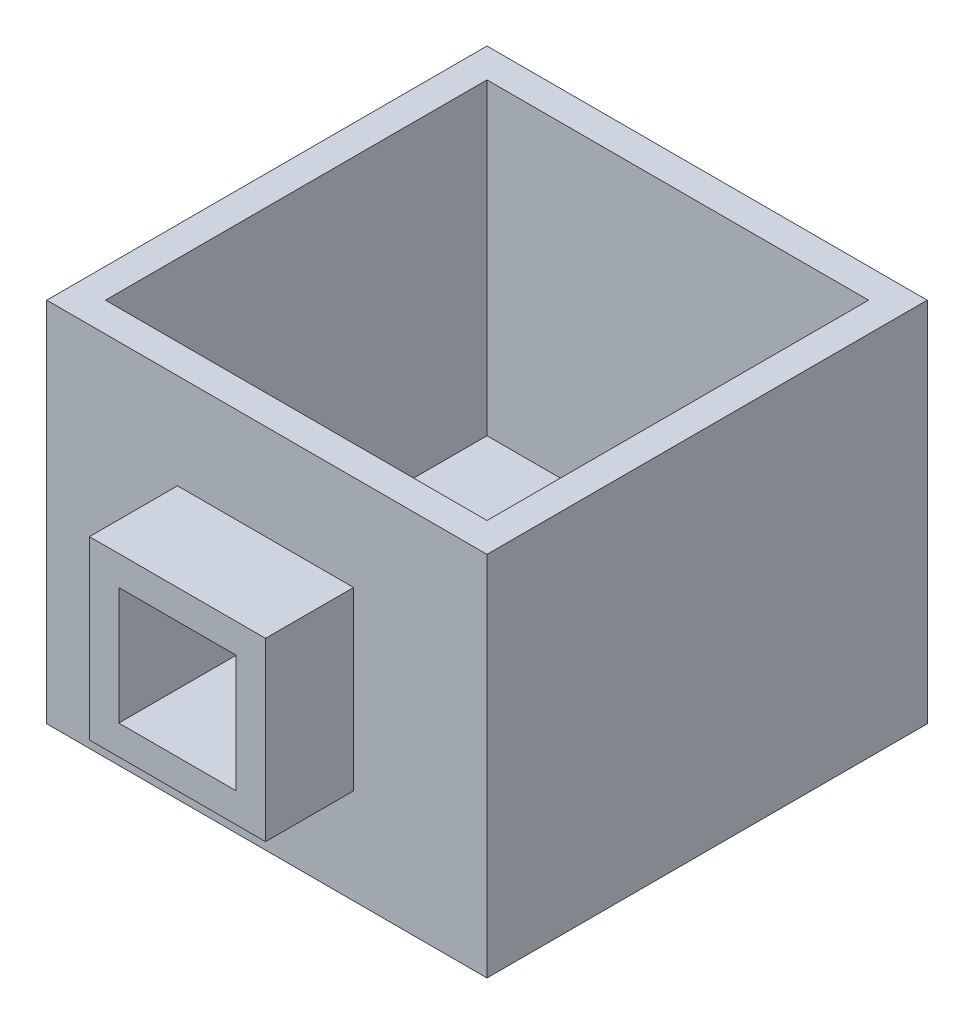
ISO-10303-21;
HEADER;
FILE_DESCRIPTION(('STEP AP214'),'2;1');
FILE_NAME('part.step','',(''),(''),'','','');
FILE_SCHEMA(('AUTOMOTIVE_DESIGN { 1 0 10303 214 1 1 1 1 }'));
ENDSEC;
DATA;
#1=APPLICATION_CONTEXT('core data for automotive mechanical design processes');
#2=APPLICATION_PROTOCOL_DEFINITION('international standard','automotive_design',2000,#1);
#3=PRODUCT_CONTEXT('',#1,'mechanical');
#4=PRODUCT('Part','Part','',(#3));
#5=PRODUCT_RELATED_PRODUCT_CATEGORY('part','',(#4));
#6=PRODUCT_DEFINITION_FORMATION('','',#4);
#7=PRODUCT_DEFINITION_CONTEXT('part definition',#1,'design');
#8=PRODUCT_DEFINITION('design','',#6,#7);
#9=PRODUCT_DEFINITION_SHAPE('','',#8);
#10=(LENGTH_UNIT() NAMED_UNIT(*) SI_UNIT(.MILLI.,.METRE.));
#11=(NAMED_UNIT(*) PLANE_ANGLE_UNIT() SI_UNIT($,.RADIAN.));
#12=(NAMED_UNIT(*) SI_UNIT($,.STERADIAN.) SOLID_ANGLE_UNIT());
#13=UNCERTAINTY_MEASURE_WITH_UNIT(LENGTH_MEASURE(1.E-05),#10,'distance_accuracy_value','');
#14=(GEOMETRIC_REPRESENTATION_CONTEXT(3) GLOBAL_UNCERTAINTY_ASSIGNED_CONTEXT((#13)) GLOBAL_UNIT_ASSIGNED_CONTEXT((#10,
#11,#12)) REPRESENTATION_CONTEXT('',''));
#15=CARTESIAN_POINT('',(0.,0.,0.));
#16=DIRECTION('',(0.,0.,1.));
#17=DIRECTION('',(1.,0.,0.));
#18=AXIS2_PLACEMENT_3D('',#15,#16,#17);
#19=CARTESIAN_POINT('',(0.,-250.,0.));
#20=DIRECTION('',(-1.,0.,0.));
#21=DIRECTION('',(0.,0.,1.));
#22=AXIS2_PLACEMENT_3D('',#19,#20,#21);
#23=PLANE('',#22);
#24=DIRECTION('',(0.,0.,1.));
#25=VECTOR('',#24,1.);
#26=CARTESIAN_POINT('',(0.,0.,0.));
#27=LINE('',#26,#25);
#28=CARTESIAN_POINT('',(0.,0.,0.));
#29=VERTEX_POINT('',#28);
#30=CARTESIAN_POINT('',(0.,0.,300.));
#31=VERTEX_POINT('',#30);
#32=EDGE_CURVE('E233',#29,#31,#27,.T.);
#33=ORIENTED_EDGE('',*,*,#32,.F.);
#34=DIRECTION('',(0.,1.,0.));
#35=VECTOR('',#34,1.);
#36=CARTESIAN_POINT('',(0.,-250.,0.));
#37=LINE('',#36,#35);
#38=CARTESIAN_POINT('',(0.,-250.,0.));
#39=VERTEX_POINT('',#38);
#40=EDGE_CURVE('E11',#39,#29,#37,.T.);
#41=ORIENTED_EDGE('',*,*,#40,.F.);
#42=DIRECTION('',(0.,0.,1.));
#43=VECTOR('',#42,1.);
#44=CARTESIAN_POINT('',(0.,-250.,0.));
#45=LINE('',#44,#43);
#46=CARTESIAN_POINT('',(0.,-250.,300.));
#47=VERTEX_POINT('',#46);
#48=EDGE_CURVE('E240',#39,#47,#45,.T.);
#49=ORIENTED_EDGE('',*,*,#48,.T.);
#50=DIRECTION('',(0.,1.,0.));
#51=VECTOR('',#50,1.);
#52=CARTESIAN_POINT('',(0.,-250.,300.));
#53=LINE('',#52,#51);
#54=EDGE_CURVE('E36',#47,#31,#53,.T.);
#55=ORIENTED_EDGE('',*,*,#54,.T.);
#56=EDGE_LOOP('',(#33,#41,#49,#55));
#57=FACE_BOUND('',#56,.T.);
#58=ADVANCED_FACE('F33',(#57),#23,.T.);
#59=CARTESIAN_POINT('',(0.,-250.,0.));
#60=DIRECTION('',(0.,0.,-1.));
#61=DIRECTION('',(-1.,0.,0.));
#62=AXIS2_PLACEMENT_3D('',#59,#60,#61);
#63=PLANE('',#62);
#64=DIRECTION('',(-1.,0.,0.));
#65=VECTOR('',#64,1.);
#66=CARTESIAN_POINT('',(0.,0.,0.));
#67=LINE('',#66,#65);
#68=CARTESIAN_POINT('',(300.,0.,0.));
#69=VERTEX_POINT('',#68);
#70=EDGE_CURVE('E244',#69,#29,#67,.T.);
#71=ORIENTED_EDGE('',*,*,#70,.F.);
#72=DIRECTION('',(0.,1.,0.));
#73=VECTOR('',#72,1.);
#74=CARTESIAN_POINT('',(300.,-250.,0.));
#75=LINE('',#74,#73);
#76=CARTESIAN_POINT('',(300.,-250.,0.));
#77=VERTEX_POINT('',#76);
#78=EDGE_CURVE('E41',#77,#69,#75,.T.);
#79=ORIENTED_EDGE('',*,*,#78,.F.);
#80=DIRECTION('',(-1.,0.,0.));
#81=VECTOR('',#80,1.);
#82=CARTESIAN_POINT('',(0.,-250.,0.));
#83=LINE('',#82,#81);
#84=EDGE_CURVE('E250',#77,#39,#83,.T.);
#85=ORIENTED_EDGE('',*,*,#84,.T.);
#86=ORIENTED_EDGE('',*,*,#40,.T.);
#87=EDGE_LOOP('',(#71,#79,#85,#86));
#88=FACE_BOUND('',#87,.T.);
#89=ADVANCED_FACE('F276',(#88),#63,.T.);
#90=CARTESIAN_POINT('',(300.,-250.,0.));
#91=DIRECTION('',(1.,0.,0.));
#92=DIRECTION('',(0.,0.,-1.));
#93=AXIS2_PLACEMENT_3D('',#90,#91,#92);
#94=PLANE('',#93);
#95=DIRECTION('',(0.,0.,-1.));
#96=VECTOR('',#95,1.);
#97=CARTESIAN_POINT('',(300.,0.,0.));
#98=LINE('',#97,#96);
#99=CARTESIAN_POINT('',(300.,0.,300.));
#100=VERTEX_POINT('',#99);
#101=EDGE_CURVE('E258',#100,#69,#98,.T.);
#102=ORIENTED_EDGE('',*,*,#101,.F.);
#103=DIRECTION('',(0.,1.,0.));
#104=VECTOR('',#103,1.);
#105=CARTESIAN_POINT('',(300.,-250.,300.));
#106=LINE('',#105,#104);
#107=CARTESIAN_POINT('',(300.,-250.,300.));
#108=VERTEX_POINT('',#107);
#109=EDGE_CURVE('E263',#108,#100,#106,.T.);
#110=ORIENTED_EDGE('',*,*,#109,.F.);
#111=DIRECTION('',(0.,0.,-1.));
#112=VECTOR('',#111,1.);
#113=CARTESIAN_POINT('',(300.,-250.,0.));
#114=LINE('',#113,#112);
#115=EDGE_CURVE('E247',#108,#77,#114,.T.);
#116=ORIENTED_EDGE('',*,*,#115,.T.);
#117=ORIENTED_EDGE('',*,*,#78,.T.);
#118=EDGE_LOOP('',(#102,#110,#116,#117));
#119=FACE_BOUND('',#118,.T.);
#120=ADVANCED_FACE('F282',(#119),#94,.T.);
#121=CARTESIAN_POINT('',(0.,-250.,300.));
#122=DIRECTION('',(0.,0.,1.));
#123=DIRECTION('',(1.,0.,0.));
#124=AXIS2_PLACEMENT_3D('',#121,#122,#123);
#125=PLANE('',#124);
#126=DIRECTION('',(0.,-1.,0.));
#127=VECTOR('',#126,1.);
#128=CARTESIAN_POINT('',(89.0887472113792,-65.,300.));
#129=LINE('',#128,#127);
#130=CARTESIAN_POINT('',(89.0887472113792,-65.,300.));
#131=VERTEX_POINT('',#130);
#132=CARTESIAN_POINT('',(89.0887472113792,-185.,300.));
#133=VERTEX_POINT('',#132);
#134=EDGE_CURVE('E174',#131,#133,#129,.T.);
#135=ORIENTED_EDGE('',*,*,#134,.F.);
#136=DIRECTION('',(-1.,0.,0.));
#137=VECTOR('',#136,1.);
#138=CARTESIAN_POINT('',(89.0887472113792,-65.,300.));
#139=LINE('',#138,#137);
#140=CARTESIAN_POINT('',(209.088747211379,-65.,300.));
#141=VERTEX_POINT('',#140);
#142=EDGE_CURVE('E179',#141,#131,#139,.T.);
#143=ORIENTED_EDGE('',*,*,#142,.F.);
#144=DIRECTION('',(0.,1.,0.));
#145=VECTOR('',#144,1.);
#146=CARTESIAN_POINT('',(209.088747211379,-65.,300.));
#147=LINE('',#146,#145);
#148=CARTESIAN_POINT('',(209.088747211379,-185.,300.));
#149=VERTEX_POINT('',#148);
#150=EDGE_CURVE('E191',#149,#141,#147,.T.);
#151=ORIENTED_EDGE('',*,*,#150,.F.);
#152=DIRECTION('',(1.,0.,0.));
#153=VECTOR('',#152,1.);
#154=CARTESIAN_POINT('',(89.0887472113792,-185.,300.));
#155=LINE('',#154,#153);
#156=EDGE_CURVE('E188',#133,#149,#155,.T.);
#157=ORIENTED_EDGE('',*,*,#156,.F.);
#158=EDGE_LOOP('',(#135,#143,#151,#157));
#159=FACE_BOUND('',#158,.T.);
#160=DIRECTION('',(1.,0.,0.));
#161=VECTOR('',#160,1.);
#162=CARTESIAN_POINT('',(0.,0.,300.));
#163=LINE('',#162,#161);
#164=EDGE_CURVE('E255',#31,#100,#163,.T.);
#165=ORIENTED_EDGE('',*,*,#164,.F.);
#166=ORIENTED_EDGE('',*,*,#54,.F.);
#167=DIRECTION('',(1.,0.,0.));
#168=VECTOR('',#167,1.);
#169=CARTESIAN_POINT('',(0.,-250.,300.));
#170=LINE('',#169,#168);
#171=EDGE_CURVE('E243',#47,#108,#170,.T.);
#172=ORIENTED_EDGE('',*,*,#171,.T.);
#173=ORIENTED_EDGE('',*,*,#109,.T.);
#174=EDGE_LOOP('',(#165,#166,#172,#173));
#175=FACE_BOUND('',#174,.T.);
#176=ADVANCED_FACE('F271',(#159,#175),#125,.T.);
#177=CARTESIAN_POINT('',(0.,-250.,0.));
#178=DIRECTION('',(0.,1.,0.));
#179=DIRECTION('',(0.,0.,1.));
#180=AXIS2_PLACEMENT_3D('',#177,#178,#179);
#181=PLANE('',#180);
#182=ORIENTED_EDGE('',*,*,#48,.F.);
#183=ORIENTED_EDGE('',*,*,#84,.F.);
#184=ORIENTED_EDGE('',*,*,#115,.F.);
#185=ORIENTED_EDGE('',*,*,#171,.F.);
#186=EDGE_LOOP('',(#182,#183,#184,#185));
#187=FACE_BOUND('',#186,.T.);
#188=ADVANCED_FACE('F279',(#187),#181,.F.);
#189=CARTESIAN_POINT('',(0.,0.,0.));
#190=DIRECTION('',(0.,1.,0.));
#191=DIRECTION('',(0.,0.,1.));
#192=AXIS2_PLACEMENT_3D('',#189,#190,#191);
#193=PLANE('',#192);
#194=DIRECTION('',(0.,0.,1.));
#195=VECTOR('',#194,1.);
#196=CARTESIAN_POINT('',(20.,0.,20.));
#197=LINE('',#196,#195);
#198=CARTESIAN_POINT('',(20.,0.,20.));
#199=VERTEX_POINT('',#198);
#200=CARTESIAN_POINT('',(20.,0.,280.));
#201=VERTEX_POINT('',#200);
#202=EDGE_CURVE('E207',#199,#201,#197,.T.);
#203=ORIENTED_EDGE('',*,*,#202,.F.);
#204=DIRECTION('',(-1.,0.,0.));
#205=VECTOR('',#204,1.);
#206=CARTESIAN_POINT('',(20.,0.,20.));
#207=LINE('',#206,#205);
#208=CARTESIAN_POINT('',(280.,0.,20.));
#209=VERTEX_POINT('',#208);
#210=EDGE_CURVE('E212',#209,#199,#207,.T.);
#211=ORIENTED_EDGE('',*,*,#210,.F.);
#212=DIRECTION('',(0.,0.,-1.));
#213=VECTOR('',#212,1.);
#214=CARTESIAN_POINT('',(280.,0.,20.));
#215=LINE('',#214,#213);
#216=CARTESIAN_POINT('',(280.,0.,280.));
#217=VERTEX_POINT('',#216);
#218=EDGE_CURVE('E226',#217,#209,#215,.T.);
#219=ORIENTED_EDGE('',*,*,#218,.F.);
#220=DIRECTION('',(1.,0.,0.));
#221=VECTOR('',#220,1.);
#222=CARTESIAN_POINT('',(20.,0.,280.));
#223=LINE('',#222,#221);
#224=EDGE_CURVE('E223',#201,#217,#223,.T.);
#225=ORIENTED_EDGE('',*,*,#224,.F.);
#226=EDGE_LOOP('',(#203,#211,#219,#225));
#227=FACE_BOUND('',#226,.T.);
#228=ORIENTED_EDGE('',*,*,#32,.T.);
#229=ORIENTED_EDGE('',*,*,#164,.T.);
#230=ORIENTED_EDGE('',*,*,#101,.T.);
#231=ORIENTED_EDGE('',*,*,#70,.T.);
#232=EDGE_LOOP('',(#228,#229,#230,#231));
#233=FACE_BOUND('',#232,.T.);
#234=ADVANCED_FACE('F273',(#227,#233),#193,.T.);
#235=CARTESIAN_POINT('',(20.,-210.,20.));
#236=DIRECTION('',(-1.,0.,0.));
#237=DIRECTION('',(0.,0.,1.));
#238=AXIS2_PLACEMENT_3D('',#235,#236,#237);
#239=PLANE('',#238);
#240=ORIENTED_EDGE('',*,*,#202,.T.);
#241=DIRECTION('',(0.,1.,0.));
#242=VECTOR('',#241,1.);
#243=CARTESIAN_POINT('',(20.,-210.,280.));
#244=LINE('',#243,#242);
#245=CARTESIAN_POINT('',(20.,-210.,280.));
#246=VERTEX_POINT('',#245);
#247=EDGE_CURVE('E221',#246,#201,#244,.T.);
#248=ORIENTED_EDGE('',*,*,#247,.F.);
#249=DIRECTION('',(0.,0.,1.));
#250=VECTOR('',#249,1.);
#251=CARTESIAN_POINT('',(20.,-210.,20.));
#252=LINE('',#251,#250);
#253=CARTESIAN_POINT('',(20.,-210.,20.));
#254=VERTEX_POINT('',#253);
#255=EDGE_CURVE('E208',#254,#246,#252,.T.);
#256=ORIENTED_EDGE('',*,*,#255,.F.);
#257=DIRECTION('',(0.,1.,0.));
#258=VECTOR('',#257,1.);
#259=CARTESIAN_POINT('',(20.,-210.,20.));
#260=LINE('',#259,#258);
#261=EDGE_CURVE('E231',#254,#199,#260,.T.);
#262=ORIENTED_EDGE('',*,*,#261,.T.);
#263=EDGE_LOOP('',(#240,#248,#256,#262));
#264=FACE_BOUND('',#263,.T.);
#265=ADVANCED_FACE('F320',(#264),#239,.F.);
#266=CARTESIAN_POINT('',(20.,-210.,20.));
#267=DIRECTION('',(0.,0.,-1.));
#268=DIRECTION('',(-1.,0.,0.));
#269=AXIS2_PLACEMENT_3D('',#266,#267,#268);
#270=PLANE('',#269);
#271=ORIENTED_EDGE('',*,*,#210,.T.);
#272=ORIENTED_EDGE('',*,*,#261,.F.);
#273=DIRECTION('',(-1.,0.,0.));
#274=VECTOR('',#273,1.);
#275=CARTESIAN_POINT('',(20.,-210.,20.));
#276=LINE('',#275,#274);
#277=CARTESIAN_POINT('',(280.,-210.,20.));
#278=VERTEX_POINT('',#277);
#279=EDGE_CURVE('E218',#278,#254,#276,.T.);
#280=ORIENTED_EDGE('',*,*,#279,.F.);
#281=DIRECTION('',(0.,1.,0.));
#282=VECTOR('',#281,1.);
#283=CARTESIAN_POINT('',(280.,-210.,20.));
#284=LINE('',#283,#282);
#285=EDGE_CURVE('E234',#278,#209,#284,.T.);
#286=ORIENTED_EDGE('',*,*,#285,.T.);
#287=EDGE_LOOP('',(#271,#272,#280,#286));
#288=FACE_BOUND('',#287,.T.);
#289=ADVANCED_FACE('F330',(#288),#270,.F.);
#290=CARTESIAN_POINT('',(280.,-210.,20.));
#291=DIRECTION('',(1.,0.,0.));
#292=DIRECTION('',(0.,0.,-1.));
#293=AXIS2_PLACEMENT_3D('',#290,#291,#292);
#294=PLANE('',#293);
#295=ORIENTED_EDGE('',*,*,#218,.T.);
#296=ORIENTED_EDGE('',*,*,#285,.F.);
#297=DIRECTION('',(0.,0.,-1.));
#298=VECTOR('',#297,1.);
#299=CARTESIAN_POINT('',(280.,-210.,20.));
#300=LINE('',#299,#298);
#301=CARTESIAN_POINT('',(280.,-210.,280.));
#302=VERTEX_POINT('',#301);
#303=EDGE_CURVE('E215',#302,#278,#300,.T.);
#304=ORIENTED_EDGE('',*,*,#303,.F.);
#305=DIRECTION('',(0.,1.,0.));
#306=VECTOR('',#305,1.);
#307=CARTESIAN_POINT('',(280.,-210.,280.));
#308=LINE('',#307,#306);
#309=EDGE_CURVE('E236',#302,#217,#308,.T.);
#310=ORIENTED_EDGE('',*,*,#309,.T.);
#311=EDGE_LOOP('',(#295,#296,#304,#310));
#312=FACE_BOUND('',#311,.T.);
#313=ADVANCED_FACE('F340',(#312),#294,.F.);
#314=CARTESIAN_POINT('',(20.,-210.,280.));
#315=DIRECTION('',(0.,0.,1.));
#316=DIRECTION('',(1.,0.,0.));
#317=AXIS2_PLACEMENT_3D('',#314,#315,#316);
#318=PLANE('',#317);
#319=DIRECTION('',(0.,1.,0.));
#320=VECTOR('',#319,1.);
#321=CARTESIAN_POINT('',(109.088747211379,-85.,280.));
#322=LINE('',#321,#320);
#323=CARTESIAN_POINT('',(109.088747211379,-165.,280.));
#324=VERTEX_POINT('',#323);
#325=CARTESIAN_POINT('',(109.088747211379,-85.,280.));
#326=VERTEX_POINT('',#325);
#327=EDGE_CURVE('E157',#324,#326,#322,.T.);
#328=ORIENTED_EDGE('',*,*,#327,.F.);
#329=DIRECTION('',(-1.,0.,0.));
#330=VECTOR('',#329,1.);
#331=CARTESIAN_POINT('',(109.088747211379,-165.,280.));
#332=LINE('',#331,#330);
#333=CARTESIAN_POINT('',(189.088747211379,-165.,280.));
#334=VERTEX_POINT('',#333);
#335=EDGE_CURVE('E49',#334,#324,#332,.T.);
#336=ORIENTED_EDGE('',*,*,#335,.F.);
#337=DIRECTION('',(0.,-1.,0.));
#338=VECTOR('',#337,1.);
#339=CARTESIAN_POINT('',(189.088747211379,-85.,280.));
#340=LINE('',#339,#338);
#341=CARTESIAN_POINT('',(189.088747211379,-85.,280.));
#342=VERTEX_POINT('',#341);
#343=EDGE_CURVE('E164',#342,#334,#340,.T.);
#344=ORIENTED_EDGE('',*,*,#343,.F.);
#345=DIRECTION('',(1.,0.,0.));
#346=VECTOR('',#345,1.);
#347=CARTESIAN_POINT('',(109.088747211379,-85.,280.));
#348=LINE('',#347,#346);
#349=EDGE_CURVE('E148',#326,#342,#348,.T.);
#350=ORIENTED_EDGE('',*,*,#349,.F.);
#351=EDGE_LOOP('',(#328,#336,#344,#350));
#352=FACE_BOUND('',#351,.T.);
#353=ORIENTED_EDGE('',*,*,#224,.T.);
#354=ORIENTED_EDGE('',*,*,#309,.F.);
#355=DIRECTION('',(1.,0.,0.));
#356=VECTOR('',#355,1.);
#357=CARTESIAN_POINT('',(20.,-210.,280.));
#358=LINE('',#357,#356);
#359=EDGE_CURVE('E211',#246,#302,#358,.T.);
#360=ORIENTED_EDGE('',*,*,#359,.F.);
#361=ORIENTED_EDGE('',*,*,#247,.T.);
#362=EDGE_LOOP('',(#353,#354,#360,#361));
#363=FACE_BOUND('',#362,.T.);
#364=ADVANCED_FACE('F161',(#352,#363),#318,.F.);
#365=CARTESIAN_POINT('',(0.,-210.,0.));
#366=DIRECTION('',(0.,1.,0.));
#367=DIRECTION('',(0.,0.,1.));
#368=AXIS2_PLACEMENT_3D('',#365,#366,#367);
#369=PLANE('',#368);
#370=ORIENTED_EDGE('',*,*,#255,.T.);
#371=ORIENTED_EDGE('',*,*,#359,.T.);
#372=ORIENTED_EDGE('',*,*,#303,.T.);
#373=ORIENTED_EDGE('',*,*,#279,.T.);
#374=EDGE_LOOP('',(#370,#371,#372,#373));
#375=FACE_BOUND('',#374,.T.);
#376=ADVANCED_FACE('F357',(#375),#369,.T.);
#377=CARTESIAN_POINT('',(89.0887472113792,-65.,360.));
#378=DIRECTION('',(1.,0.,0.));
#379=DIRECTION('',(0.,1.,0.));
#380=AXIS2_PLACEMENT_3D('',#377,#378,#379);
#381=PLANE('',#380);
#382=ORIENTED_EDGE('',*,*,#134,.T.);
#383=DIRECTION('',(0.,0.,-1.));
#384=VECTOR('',#383,1.);
#385=CARTESIAN_POINT('',(89.0887472113792,-185.,360.));
#386=LINE('',#385,#384);
#387=CARTESIAN_POINT('',(89.0887472113792,-185.,360.));
#388=VERTEX_POINT('',#387);
#389=EDGE_CURVE('E204',#388,#133,#386,.T.);
#390=ORIENTED_EDGE('',*,*,#389,.F.);
#391=DIRECTION('',(0.,-1.,0.));
#392=VECTOR('',#391,1.);
#393=CARTESIAN_POINT('',(89.0887472113792,-65.,360.));
#394=LINE('',#393,#392);
#395=CARTESIAN_POINT('',(89.0887472113792,-65.,360.));
#396=VERTEX_POINT('',#395);
#397=EDGE_CURVE('E175',#396,#388,#394,.T.);
#398=ORIENTED_EDGE('',*,*,#397,.F.);
#399=DIRECTION('',(0.,0.,-1.));
#400=VECTOR('',#399,1.);
#401=CARTESIAN_POINT('',(89.0887472113792,-65.,360.));
#402=LINE('',#401,#400);
#403=EDGE_CURVE('E185',#396,#131,#402,.T.);
#404=ORIENTED_EDGE('',*,*,#403,.T.);
#405=EDGE_LOOP('',(#382,#390,#398,#404));
#406=FACE_BOUND('',#405,.T.);
#407=ADVANCED_FACE('F362',(#406),#381,.F.);
#408=CARTESIAN_POINT('',(89.0887472113792,-185.,360.));
#409=DIRECTION('',(0.,1.,0.));
#410=DIRECTION('',(0.,0.,1.));
#411=AXIS2_PLACEMENT_3D('',#408,#409,#410);
#412=PLANE('',#411);
#413=ORIENTED_EDGE('',*,*,#156,.T.);
#414=DIRECTION('',(0.,0.,-1.));
#415=VECTOR('',#414,1.);
#416=CARTESIAN_POINT('',(209.088747211379,-185.,360.));
#417=LINE('',#416,#415);
#418=CARTESIAN_POINT('',(209.088747211379,-185.,360.));
#419=VERTEX_POINT('',#418);
#420=EDGE_CURVE('E201',#419,#149,#417,.T.);
#421=ORIENTED_EDGE('',*,*,#420,.F.);
#422=DIRECTION('',(1.,0.,0.));
#423=VECTOR('',#422,1.);
#424=CARTESIAN_POINT('',(89.0887472113792,-185.,360.));
#425=LINE('',#424,#423);
#426=EDGE_CURVE('E178',#388,#419,#425,.T.);
#427=ORIENTED_EDGE('',*,*,#426,.F.);
#428=ORIENTED_EDGE('',*,*,#389,.T.);
#429=EDGE_LOOP('',(#413,#421,#427,#428));
#430=FACE_BOUND('',#429,.T.);
#431=ADVANCED_FACE('F377',(#430),#412,.F.);
#432=CARTESIAN_POINT('',(209.088747211379,-65.,360.));
#433=DIRECTION('',(-1.,0.,0.));
#434=DIRECTION('',(0.,-1.,0.));
#435=AXIS2_PLACEMENT_3D('',#432,#433,#434);
#436=PLANE('',#435);
#437=ORIENTED_EDGE('',*,*,#150,.T.);
#438=DIRECTION('',(0.,0.,-1.));
#439=VECTOR('',#438,1.);
#440=CARTESIAN_POINT('',(209.088747211379,-65.,360.));
#441=LINE('',#440,#439);
#442=CARTESIAN_POINT('',(209.088747211379,-65.,360.));
#443=VERTEX_POINT('',#442);
#444=EDGE_CURVE('E198',#443,#141,#441,.T.);
#445=ORIENTED_EDGE('',*,*,#444,.F.);
#446=DIRECTION('',(0.,1.,0.));
#447=VECTOR('',#446,1.);
#448=CARTESIAN_POINT('',(209.088747211379,-65.,360.));
#449=LINE('',#448,#447);
#450=EDGE_CURVE('E181',#419,#443,#449,.T.);
#451=ORIENTED_EDGE('',*,*,#450,.F.);
#452=ORIENTED_EDGE('',*,*,#420,.T.);
#453=EDGE_LOOP('',(#437,#445,#451,#452));
#454=FACE_BOUND('',#453,.T.);
#455=ADVANCED_FACE('F387',(#454),#436,.F.);
#456=CARTESIAN_POINT('',(89.0887472113792,-65.,360.));
#457=DIRECTION('',(0.,-1.,0.));
#458=DIRECTION('',(1.,0.,0.));
#459=AXIS2_PLACEMENT_3D('',#456,#457,#458);
#460=PLANE('',#459);
#461=ORIENTED_EDGE('',*,*,#142,.T.);
#462=ORIENTED_EDGE('',*,*,#403,.F.);
#463=DIRECTION('',(-1.,0.,0.));
#464=VECTOR('',#463,1.);
#465=CARTESIAN_POINT('',(89.0887472113792,-65.,360.));
#466=LINE('',#465,#464);
#467=EDGE_CURVE('E183',#443,#396,#466,.T.);
#468=ORIENTED_EDGE('',*,*,#467,.F.);
#469=ORIENTED_EDGE('',*,*,#444,.T.);
#470=EDGE_LOOP('',(#461,#462,#468,#469));
#471=FACE_BOUND('',#470,.T.);
#472=ADVANCED_FACE('F397',(#471),#460,.F.);
#473=CARTESIAN_POINT('',(0.,0.,360.));
#474=DIRECTION('',(0.,0.,1.));
#475=DIRECTION('',(1.,0.,0.));
#476=AXIS2_PLACEMENT_3D('',#473,#474,#475);
#477=PLANE('',#476);
#478=DIRECTION('',(1.,0.,0.));
#479=VECTOR('',#478,1.);
#480=CARTESIAN_POINT('',(109.088747211379,-165.,360.));
#481=LINE('',#480,#479);
#482=CARTESIAN_POINT('',(109.088747211379,-165.,360.));
#483=VERTEX_POINT('',#482);
#484=CARTESIAN_POINT('',(189.088747211379,-165.,360.));
#485=VERTEX_POINT('',#484);
#486=EDGE_CURVE('E469',#483,#485,#481,.T.);
#487=ORIENTED_EDGE('',*,*,#486,.F.);
#488=DIRECTION('',(0.,-1.,0.));
#489=VECTOR('',#488,1.);
#490=CARTESIAN_POINT('',(109.088747211379,-85.,360.));
#491=LINE('',#490,#489);
#492=CARTESIAN_POINT('',(109.088747211379,-85.,360.));
#493=VERTEX_POINT('',#492);
#494=EDGE_CURVE('E166',#493,#483,#491,.T.);
#495=ORIENTED_EDGE('',*,*,#494,.F.);
#496=DIRECTION('',(-1.,0.,0.));
#497=VECTOR('',#496,1.);
#498=CARTESIAN_POINT('',(109.088747211379,-85.,360.));
#499=LINE('',#498,#497);
#500=CARTESIAN_POINT('',(189.088747211379,-85.,360.));
#501=VERTEX_POINT('',#500);
#502=EDGE_CURVE('E57',#501,#493,#499,.T.);
#503=ORIENTED_EDGE('',*,*,#502,.F.);
#504=DIRECTION('',(0.,1.,0.));
#505=VECTOR('',#504,1.);
#506=CARTESIAN_POINT('',(189.088747211379,-85.,360.));
#507=LINE('',#506,#505);
#508=EDGE_CURVE('E467',#485,#501,#507,.T.);
#509=ORIENTED_EDGE('',*,*,#508,.F.);
#510=EDGE_LOOP('',(#487,#495,#503,#509));
#511=FACE_BOUND('',#510,.T.);
#512=ORIENTED_EDGE('',*,*,#397,.T.);
#513=ORIENTED_EDGE('',*,*,#426,.T.);
#514=ORIENTED_EDGE('',*,*,#450,.T.);
#515=ORIENTED_EDGE('',*,*,#467,.T.);
#516=EDGE_LOOP('',(#512,#513,#514,#515));
#517=FACE_BOUND('',#516,.T.);
#518=ADVANCED_FACE('F407',(#511,#517),#477,.T.);
#519=CARTESIAN_POINT('',(109.088747211379,-165.,-0.000999999999973245));
#520=DIRECTION('',(0.,-1.,0.));
#521=DIRECTION('',(0.,0.,-1.));
#522=AXIS2_PLACEMENT_3D('',#519,#520,#521);
#523=PLANE('',#522);
#524=ORIENTED_EDGE('',*,*,#335,.T.);
#525=DIRECTION('',(0.,0.,1.));
#526=VECTOR('',#525,1.);
#527=CARTESIAN_POINT('',(109.088747211379,-165.,-0.000999999999973245));
#528=LINE('',#527,#526);
#529=EDGE_CURVE('E153',#324,#483,#528,.T.);
#530=ORIENTED_EDGE('',*,*,#529,.T.);
#531=ORIENTED_EDGE('',*,*,#486,.T.);
#532=DIRECTION('',(0.,0.,1.));
#533=VECTOR('',#532,1.);
#534=CARTESIAN_POINT('',(189.088747211379,-165.,-0.000999999999973245));
#535=LINE('',#534,#533);
#536=EDGE_CURVE('E171',#334,#485,#535,.T.);
#537=ORIENTED_EDGE('',*,*,#536,.F.);
#538=EDGE_LOOP('',(#524,#530,#531,#537));
#539=FACE_BOUND('',#538,.T.);
#540=ADVANCED_FACE('F423',(#539),#523,.F.);
#541=CARTESIAN_POINT('',(189.088747211379,-85.,-0.000999999999973245));
#542=DIRECTION('',(1.,0.,0.));
#543=DIRECTION('',(0.,0.,-1.));
#544=AXIS2_PLACEMENT_3D('',#541,#542,#543);
#545=PLANE('',#544);
#546=ORIENTED_EDGE('',*,*,#343,.T.);
#547=ORIENTED_EDGE('',*,*,#536,.T.);
#548=ORIENTED_EDGE('',*,*,#508,.T.);
#549=DIRECTION('',(0.,0.,1.));
#550=VECTOR('',#549,1.);
#551=CARTESIAN_POINT('',(189.088747211379,-85.,-0.000999999999973245));
#552=LINE('',#551,#550);
#553=EDGE_CURVE('E154',#342,#501,#552,.T.);
#554=ORIENTED_EDGE('',*,*,#553,.F.);
#555=EDGE_LOOP('',(#546,#547,#548,#554));
#556=FACE_BOUND('',#555,.T.);
#557=ADVANCED_FACE('F433',(#556),#545,.F.);
#558=CARTESIAN_POINT('',(109.088747211379,-85.,-0.000999999999973245));
#559=DIRECTION('',(0.,1.,0.));
#560=DIRECTION('',(0.,0.,1.));
#561=AXIS2_PLACEMENT_3D('',#558,#559,#560);
#562=PLANE('',#561);
#563=ORIENTED_EDGE('',*,*,#349,.T.);
#564=ORIENTED_EDGE('',*,*,#553,.T.);
#565=ORIENTED_EDGE('',*,*,#502,.T.);
#566=DIRECTION('',(0.,0.,1.));
#567=VECTOR('',#566,1.);
#568=CARTESIAN_POINT('',(109.088747211379,-85.,-0.000999999999973245));
#569=LINE('',#568,#567);
#570=EDGE_CURVE('E144',#326,#493,#569,.T.);
#571=ORIENTED_EDGE('',*,*,#570,.F.);
#572=EDGE_LOOP('',(#563,#564,#565,#571));
#573=FACE_BOUND('',#572,.T.);
#574=ADVANCED_FACE('F146',(#573),#562,.F.);
#575=CARTESIAN_POINT('',(109.088747211379,-85.,-0.000999999999973245));
#576=DIRECTION('',(-1.,0.,0.));
#577=DIRECTION('',(0.,-1.,0.));
#578=AXIS2_PLACEMENT_3D('',#575,#576,#577);
#579=PLANE('',#578);
#580=ORIENTED_EDGE('',*,*,#327,.T.);
#581=ORIENTED_EDGE('',*,*,#570,.T.);
#582=ORIENTED_EDGE('',*,*,#494,.T.);
#583=ORIENTED_EDGE('',*,*,#529,.F.);
#584=EDGE_LOOP('',(#580,#581,#582,#583));
#585=FACE_BOUND('',#584,.T.);
#586=ADVANCED_FACE('F158',(#585),#579,.F.);
#587=CLOSED_SHELL('',(#58,#89,#120,#176,#188,#234,#265,#289,#313,#364,#376,#407,#431,#455,#472,
#518,#540,#557,#574,#586));
#588=MANIFOLD_SOLID_BREP('B2',#587);
#589=ADVANCED_BREP_SHAPE_REPRESENTATION('',(#18,#588),#14);
#590=SHAPE_DEFINITION_REPRESENTATION(#9,#589);
ENDSEC;
END-ISO-10303-21;
